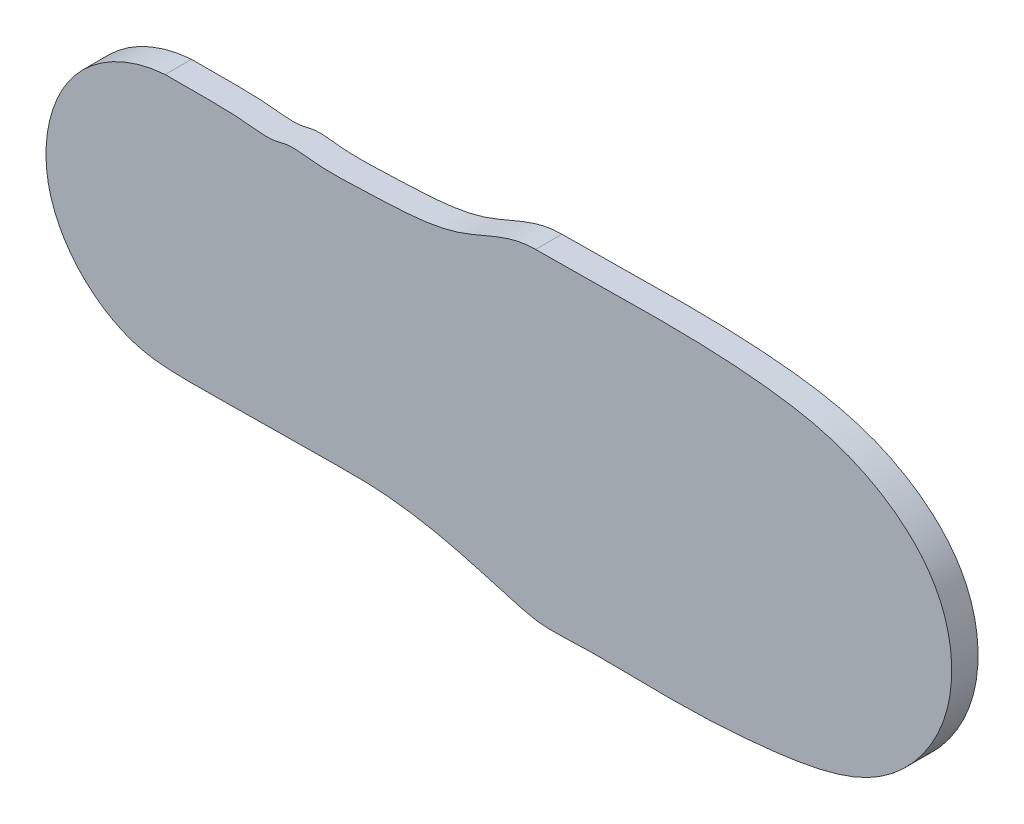
ISO-10303-21;
HEADER;
FILE_DESCRIPTION(('STEP AP214'),'2;1');
FILE_NAME('part.step','',(''),(''),'','','');
FILE_SCHEMA(('AUTOMOTIVE_DESIGN { 1 0 10303 214 1 1 1 1 }'));
ENDSEC;
DATA;
#1=APPLICATION_CONTEXT('core data for automotive mechanical design processes');
#2=APPLICATION_PROTOCOL_DEFINITION('international standard','automotive_design',2000,#1);
#3=PRODUCT_CONTEXT('',#1,'mechanical');
#4=PRODUCT('Part','Part','',(#3));
#5=PRODUCT_RELATED_PRODUCT_CATEGORY('part','',(#4));
#6=PRODUCT_DEFINITION_FORMATION('','',#4);
#7=PRODUCT_DEFINITION_CONTEXT('part definition',#1,'design');
#8=PRODUCT_DEFINITION('design','',#6,#7);
#9=PRODUCT_DEFINITION_SHAPE('','',#8);
#10=(LENGTH_UNIT() NAMED_UNIT(*) SI_UNIT(.MILLI.,.METRE.));
#11=(NAMED_UNIT(*) PLANE_ANGLE_UNIT() SI_UNIT($,.RADIAN.));
#12=(NAMED_UNIT(*) SI_UNIT($,.STERADIAN.) SOLID_ANGLE_UNIT());
#13=UNCERTAINTY_MEASURE_WITH_UNIT(LENGTH_MEASURE(1.E-05),#10,'distance_accuracy_value','');
#14=(GEOMETRIC_REPRESENTATION_CONTEXT(3) GLOBAL_UNCERTAINTY_ASSIGNED_CONTEXT((#13)) GLOBAL_UNIT_ASSIGNED_CONTEXT((#10,
#11,#12)) REPRESENTATION_CONTEXT('',''));
#15=CARTESIAN_POINT('',(0.,0.,0.));
#16=DIRECTION('',(0.,0.,1.));
#17=DIRECTION('',(1.,0.,0.));
#18=AXIS2_PLACEMENT_3D('',#15,#16,#17);
#19=CARTESIAN_POINT('',(5.53784323267048,36.0623091835957,4.3037651134611));
#20=CARTESIAN_POINT('',(-0.667896515106985,36.1062754353635,4.3037651134611));
#21=CARTESIAN_POINT('',(-11.8908272736825,28.7362865936999,4.3037651134611));
#22=CARTESIAN_POINT('',(-29.408005052225,28.453798189547,4.3037651134611));
#23=CARTESIAN_POINT('',(-42.3686762348303,27.6974632018116,4.3037651134611));
#24=CARTESIAN_POINT('',(-49.4037977130239,28.9214378329443,4.3037651134611));
#25=CARTESIAN_POINT('',(-54.0888049042547,27.4696936012756,4.3037651134611));
#26=CARTESIAN_POINT('',(-63.196499820373,28.9272768294994,4.3037651134611));
#27=CARTESIAN_POINT('',(-71.3883237083493,28.3175322316099,4.3037651134611));
#28=CARTESIAN_POINT('',(-77.6156571286976,28.4824072294366,4.3037651134611));
#29=B_SPLINE_CURVE_WITH_KNOTS('',3,(#19,#20,#21,#22,#23,#24,#25,#26,#27,#28),.UNSPECIFIED.,.F.,
.F.,(4,1,1,1,1,1,1,4),(0.,0.214022448469197,0.457131402921372,0.607226327755179,
0.680167848756412,0.70419459453478,0.779691256464848,1.),.UNSPECIFIED.);
#30=DIRECTION('',(0.,0.,-1.));
#31=VECTOR('',#30,1.);
#32=SURFACE_OF_LINEAR_EXTRUSION('',#29,#31);
#33=CARTESIAN_POINT('',(5.53784323267048,36.0623091835957,-1.6093548865389));
#34=CARTESIAN_POINT('',(-0.667896515106985,36.1062754353635,-1.6093548865389));
#35=CARTESIAN_POINT('',(-11.8908272736825,28.7362865936999,-1.6093548865389));
#36=CARTESIAN_POINT('',(-29.408005052225,28.453798189547,-1.6093548865389));
#37=CARTESIAN_POINT('',(-42.3686762348303,27.6974632018116,-1.6093548865389));
#38=CARTESIAN_POINT('',(-49.4037977130239,28.9214378329443,-1.6093548865389));
#39=CARTESIAN_POINT('',(-54.0888049042547,27.4696936012756,-1.6093548865389));
#40=CARTESIAN_POINT('',(-63.196499820373,28.9272768294994,-1.6093548865389));
#41=CARTESIAN_POINT('',(-71.3883237083493,28.3175322316099,-1.6093548865389));
#42=CARTESIAN_POINT('',(-77.6156571286976,28.4824072294366,-1.6093548865389));
#43=B_SPLINE_CURVE_WITH_KNOTS('',3,(#33,#34,#35,#36,#37,#38,#39,#40,#41,#42),.UNSPECIFIED.,.F.,
.F.,(4,1,1,1,1,1,1,4),(0.,0.214022448469197,0.457131402921372,0.607226327755179,
0.680167848756412,0.70419459453478,0.779691256464848,1.),.UNSPECIFIED.);
#44=CARTESIAN_POINT('',(5.53784323267048,36.0623091835957,-1.6093548865389));
#45=VERTEX_POINT('',#44);
#46=CARTESIAN_POINT('',(-77.6156571286976,28.4824072294366,-1.6093548865389));
#47=VERTEX_POINT('',#46);
#48=EDGE_CURVE('E72',#45,#47,#43,.T.);
#49=ORIENTED_EDGE('',*,*,#48,.T.);
#50=DIRECTION('',(0.,0.,-1.));
#51=VECTOR('',#50,1.);
#52=CARTESIAN_POINT('',(-77.6156571286976,28.4824072294366,4.3037651134611));
#53=LINE('',#52,#51);
#54=CARTESIAN_POINT('',(-77.6156571286976,28.4824072294366,4.3037651134611));
#55=VERTEX_POINT('',#54);
#56=EDGE_CURVE('E11',#55,#47,#53,.T.);
#57=ORIENTED_EDGE('',*,*,#56,.F.);
#58=CARTESIAN_POINT('',(5.53784323267048,36.0623091835957,4.3037651134611));
#59=VERTEX_POINT('',#58);
#60=EDGE_CURVE('E71',#59,#55,#29,.T.);
#61=ORIENTED_EDGE('',*,*,#60,.F.);
#62=DIRECTION('',(0.,0.,-1.));
#63=VECTOR('',#62,1.);
#64=CARTESIAN_POINT('',(5.53784323267048,36.0623091835957,4.3037651134611));
#65=LINE('',#64,#63);
#66=EDGE_CURVE('E49',#59,#45,#65,.T.);
#67=ORIENTED_EDGE('',*,*,#66,.T.);
#68=EDGE_LOOP('',(#49,#57,#61,#67));
#69=FACE_BOUND('',#68,.T.);
#70=ADVANCED_FACE('F40',(#69),#32,.F.);
#71=CARTESIAN_POINT('',(-77.6156571286976,28.4824072294366,4.3037651134611));
#72=CARTESIAN_POINT('',(-85.5875649744661,27.9605625804674,4.3037651134611));
#73=CARTESIAN_POINT('',(-101.549940595322,19.8916099361518,4.3037651134611));
#74=CARTESIAN_POINT('',(-106.826557007277,-4.26903095621853,4.3037651134611));
#75=CARTESIAN_POINT('',(-97.1679817238527,-20.9061510966949,4.3037651134611));
#76=CARTESIAN_POINT('',(-84.8682112668781,-28.1488642451636,4.3037651134611));
#77=CARTESIAN_POINT('',(-70.3864345083841,-28.7239773765588,4.3037651134611));
#78=CARTESIAN_POINT('',(-57.5975143338619,-28.2641036045678,4.3037651134611));
#79=CARTESIAN_POINT('',(-43.5510615936016,-28.3784845754383,4.3037651134611));
#80=CARTESIAN_POINT('',(-30.055656856739,-27.8845019849263,4.3037651134611));
#81=CARTESIAN_POINT('',(-15.7498158512866,-30.0615686939403,4.3037651134611));
#82=CARTESIAN_POINT('',(-4.73785089659706,-33.2561349015479,4.3037651134611));
#83=CARTESIAN_POINT('',(1.96626798165653,-35.1793567231026,4.3037651134611));
#84=CARTESIAN_POINT('',(7.36604796278948,-36.4953784715535,4.3037651134611));
#85=CARTESIAN_POINT('',(17.7410415654543,-35.7317092993419,4.3037651134611));
#86=CARTESIAN_POINT('',(35.8973434006722,-36.4888717012406,4.3037651134611));
#87=CARTESIAN_POINT('',(58.6480674924366,-35.4369917361391,4.3037651134611));
#88=CARTESIAN_POINT('',(84.7222790305748,-30.4322315610656,4.3037651134611));
#89=CARTESIAN_POINT('',(100.83077130376,-9.06697317700586,4.3037651134611));
#90=CARTESIAN_POINT('',(97.9808595531241,17.4658282460258,4.3037651134611));
#91=CARTESIAN_POINT('',(78.7665721378371,31.671180803138,4.3037651134611));
#92=CARTESIAN_POINT('',(47.010973080433,37.5561765315106,4.3037651134611));
#93=CARTESIAN_POINT('',(22.9303150324568,36.007863310585,4.3037651134611));
#94=CARTESIAN_POINT('',(5.53784323267048,36.0623091835957,4.3037651134611));
#95=B_SPLINE_CURVE_WITH_KNOTS('',3,(#71,#72,#73,#74,#75,#76,#77,#78,#79,#80,#81,#82,#83,#84,#85,
#86,#87,#88,#89,#90,#91,#92,#93,#94),.UNSPECIFIED.,.F.,.F.,(4,1,1,1,1,1,1,1,1,1,1,1,1,1,1,1,1,1,
1,1,1,4),(0.,0.0614895592213728,0.124158776893184,0.164378570483998,0.202472134506398,
0.227838511837445,0.274367311310463,0.301011416088794,0.335563353593711,0.377828251591594,
0.411274949707023,0.423498766427471,0.431400319281546,0.45374608281543,0.502360475194352,
0.571016906675975,0.629323360908699,0.699732037006104,0.752671405076551,0.81734203230962,
0.865822424760326,1.),.UNSPECIFIED.);
#96=DIRECTION('',(0.,0.,-1.));
#97=VECTOR('',#96,1.);
#98=SURFACE_OF_LINEAR_EXTRUSION('',#95,#97);
#99=CARTESIAN_POINT('',(-77.6156571286976,28.4824072294366,-1.6093548865389));
#100=CARTESIAN_POINT('',(-85.5875649744661,27.9605625804674,-1.6093548865389));
#101=CARTESIAN_POINT('',(-101.549940595322,19.8916099361518,-1.6093548865389));
#102=CARTESIAN_POINT('',(-106.826557007277,-4.26903095621853,-1.6093548865389));
#103=CARTESIAN_POINT('',(-97.1679817238527,-20.9061510966949,-1.6093548865389));
#104=CARTESIAN_POINT('',(-84.8682112668781,-28.1488642451636,-1.6093548865389));
#105=CARTESIAN_POINT('',(-70.3864345083841,-28.7239773765588,-1.6093548865389));
#106=CARTESIAN_POINT('',(-57.5975143338619,-28.2641036045678,-1.6093548865389));
#107=CARTESIAN_POINT('',(-43.5510615936016,-28.3784845754383,-1.6093548865389));
#108=CARTESIAN_POINT('',(-30.055656856739,-27.8845019849263,-1.6093548865389));
#109=CARTESIAN_POINT('',(-15.7498158512866,-30.0615686939403,-1.6093548865389));
#110=CARTESIAN_POINT('',(-4.73785089659706,-33.2561349015479,-1.6093548865389));
#111=CARTESIAN_POINT('',(1.96626798165653,-35.1793567231026,-1.6093548865389));
#112=CARTESIAN_POINT('',(7.36604796278948,-36.4953784715535,-1.6093548865389));
#113=CARTESIAN_POINT('',(17.7410415654543,-35.7317092993419,-1.6093548865389));
#114=CARTESIAN_POINT('',(35.8973434006722,-36.4888717012406,-1.6093548865389));
#115=CARTESIAN_POINT('',(58.6480674924366,-35.4369917361391,-1.6093548865389));
#116=CARTESIAN_POINT('',(84.7222790305748,-30.4322315610656,-1.6093548865389));
#117=CARTESIAN_POINT('',(100.83077130376,-9.06697317700586,-1.6093548865389));
#118=CARTESIAN_POINT('',(97.9808595531241,17.4658282460258,-1.6093548865389));
#119=CARTESIAN_POINT('',(78.7665721378371,31.671180803138,-1.6093548865389));
#120=CARTESIAN_POINT('',(47.010973080433,37.5561765315106,-1.6093548865389));
#121=CARTESIAN_POINT('',(22.9303150324568,36.007863310585,-1.6093548865389));
#122=CARTESIAN_POINT('',(5.53784323267048,36.0623091835957,-1.6093548865389));
#123=B_SPLINE_CURVE_WITH_KNOTS('',3,(#99,#100,#101,#102,#103,#104,#105,#106,#107,#108,#109,#110,
#111,#112,#113,#114,#115,#116,#117,#118,#119,#120,#121,#122),.UNSPECIFIED.,.F.,.F.,(4,1,1,1,1,1,
1,1,1,1,1,1,1,1,1,1,1,1,1,1,1,4),(0.,0.0614895592213728,0.124158776893184,0.164378570483998,
0.202472134506398,0.227838511837445,0.274367311310463,0.301011416088794,0.335563353593711,
0.377828251591594,0.411274949707023,0.423498766427471,0.431400319281546,0.45374608281543,
0.502360475194352,0.571016906675975,0.629323360908699,0.699732037006104,0.752671405076551,
0.81734203230962,0.865822424760326,1.),.UNSPECIFIED.);
#124=EDGE_CURVE('E64',#47,#45,#123,.T.);
#125=ORIENTED_EDGE('',*,*,#124,.T.);
#126=ORIENTED_EDGE('',*,*,#66,.F.);
#127=EDGE_CURVE('E56',#55,#59,#95,.T.);
#128=ORIENTED_EDGE('',*,*,#127,.F.);
#129=ORIENTED_EDGE('',*,*,#56,.T.);
#130=EDGE_LOOP('',(#125,#126,#128,#129));
#131=FACE_BOUND('',#130,.T.);
#132=ADVANCED_FACE('F67',(#131),#98,.F.);
#133=CARTESIAN_POINT('',(-35.5496780248701,28.0855146661618,4.3037651134611));
#134=DIRECTION('',(0.,0.,-1.));
#135=DIRECTION('',(-1.,0.,0.));
#136=AXIS2_PLACEMENT_3D('',#133,#134,#135);
#137=PLANE('',#136);
#138=ORIENTED_EDGE('',*,*,#60,.T.);
#139=ORIENTED_EDGE('',*,*,#127,.T.);
#140=EDGE_LOOP('',(#138,#139));
#141=FACE_BOUND('',#140,.T.);
#142=ADVANCED_FACE('F99',(#141),#137,.F.);
#143=CARTESIAN_POINT('',(-35.5496780248701,28.0855146661618,-1.6093548865389));
#144=DIRECTION('',(0.,0.,-1.));
#145=DIRECTION('',(-1.,0.,0.));
#146=AXIS2_PLACEMENT_3D('',#143,#144,#145);
#147=PLANE('',#146);
#148=ORIENTED_EDGE('',*,*,#48,.F.);
#149=ORIENTED_EDGE('',*,*,#124,.F.);
#150=EDGE_LOOP('',(#148,#149));
#151=FACE_BOUND('',#150,.T.);
#152=ADVANCED_FACE('F75',(#151),#147,.T.);
#153=CLOSED_SHELL('',(#70,#132,#142,#152));
#154=MANIFOLD_SOLID_BREP('B2',#153);
#155=ADVANCED_BREP_SHAPE_REPRESENTATION('',(#18,#154),#14);
#156=SHAPE_DEFINITION_REPRESENTATION(#9,#155);
ENDSEC;
END-ISO-10303-21;
